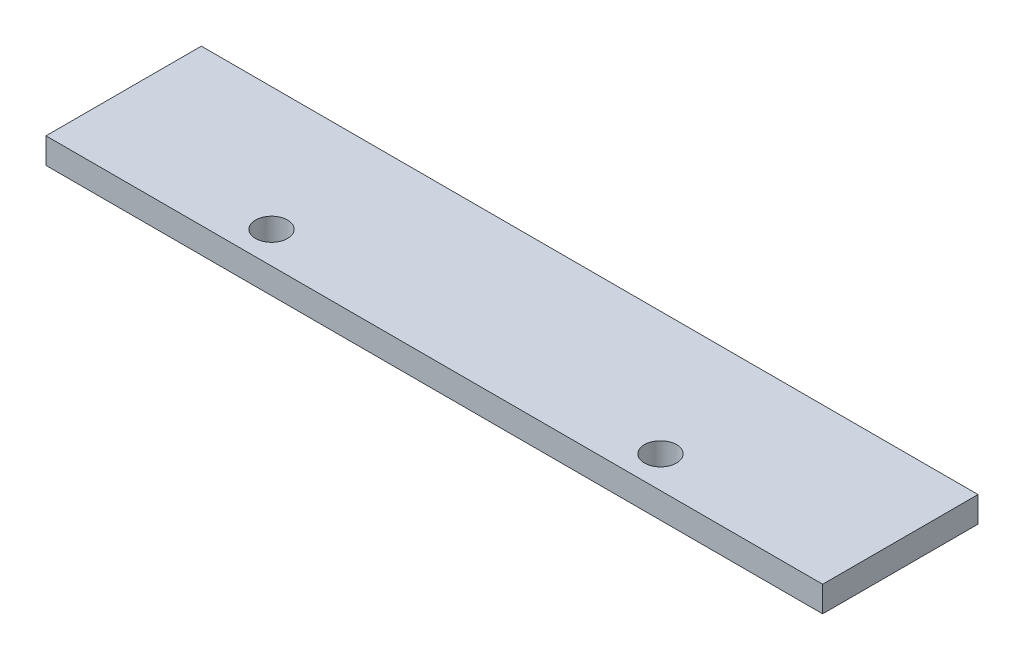
ISO-10303-21;
HEADER;
FILE_DESCRIPTION(('STEP AP214'),'2;1');
FILE_NAME('part.step','',(''),(''),'','','');
FILE_SCHEMA(('AUTOMOTIVE_DESIGN { 1 0 10303 214 1 1 1 1 }'));
ENDSEC;
DATA;
#1=APPLICATION_CONTEXT('core data for automotive mechanical design processes');
#2=APPLICATION_PROTOCOL_DEFINITION('international standard','automotive_design',2000,#1);
#3=PRODUCT_CONTEXT('',#1,'mechanical');
#4=PRODUCT('Part','Part','',(#3));
#5=PRODUCT_RELATED_PRODUCT_CATEGORY('part','',(#4));
#6=PRODUCT_DEFINITION_FORMATION('','',#4);
#7=PRODUCT_DEFINITION_CONTEXT('part definition',#1,'design');
#8=PRODUCT_DEFINITION('design','',#6,#7);
#9=PRODUCT_DEFINITION_SHAPE('','',#8);
#10=(LENGTH_UNIT() NAMED_UNIT(*) SI_UNIT(.MILLI.,.METRE.));
#11=(NAMED_UNIT(*) PLANE_ANGLE_UNIT() SI_UNIT($,.RADIAN.));
#12=(NAMED_UNIT(*) SI_UNIT($,.STERADIAN.) SOLID_ANGLE_UNIT());
#13=UNCERTAINTY_MEASURE_WITH_UNIT(LENGTH_MEASURE(1.E-05),#10,'distance_accuracy_value','');
#14=(GEOMETRIC_REPRESENTATION_CONTEXT(3) GLOBAL_UNCERTAINTY_ASSIGNED_CONTEXT((#13)) GLOBAL_UNIT_ASSIGNED_CONTEXT((#10,
#11,#12)) REPRESENTATION_CONTEXT('',''));
#15=CARTESIAN_POINT('',(0.,0.,0.));
#16=DIRECTION('',(0.,0.,1.));
#17=DIRECTION('',(1.,0.,0.));
#18=AXIS2_PLACEMENT_3D('',#15,#16,#17);
#19=CARTESIAN_POINT('',(25.55,0.845,5.11));
#20=DIRECTION('',(-1.,0.,0.));
#21=DIRECTION('',(0.,0.,1.));
#22=AXIS2_PLACEMENT_3D('',#19,#20,#21);
#23=PLANE('',#22);
#24=DIRECTION('',(0.,0.,-1.));
#25=VECTOR('',#24,1.);
#26=CARTESIAN_POINT('',(25.55,-0.845,5.11));
#27=LINE('',#26,#25);
#28=CARTESIAN_POINT('',(25.55,-0.845,5.11));
#29=VERTEX_POINT('',#28);
#30=CARTESIAN_POINT('',(25.55,-0.845,-5.11));
#31=VERTEX_POINT('',#30);
#32=EDGE_CURVE('E99',#29,#31,#27,.T.);
#33=ORIENTED_EDGE('',*,*,#32,.T.);
#34=DIRECTION('',(0.,-1.,0.));
#35=VECTOR('',#34,1.);
#36=CARTESIAN_POINT('',(25.55,0.845,-5.11));
#37=LINE('',#36,#35);
#38=CARTESIAN_POINT('',(25.55,0.845,-5.11));
#39=VERTEX_POINT('',#38);
#40=EDGE_CURVE('E11',#39,#31,#37,.T.);
#41=ORIENTED_EDGE('',*,*,#40,.F.);
#42=DIRECTION('',(0.,0.,-1.));
#43=VECTOR('',#42,1.);
#44=CARTESIAN_POINT('',(25.55,0.845,5.11));
#45=LINE('',#44,#43);
#46=CARTESIAN_POINT('',(25.55,0.845,5.11));
#47=VERTEX_POINT('',#46);
#48=EDGE_CURVE('E87',#47,#39,#45,.T.);
#49=ORIENTED_EDGE('',*,*,#48,.F.);
#50=DIRECTION('',(0.,-1.,0.));
#51=VECTOR('',#50,1.);
#52=CARTESIAN_POINT('',(25.55,0.845,5.11));
#53=LINE('',#52,#51);
#54=EDGE_CURVE('E95',#47,#29,#53,.T.);
#55=ORIENTED_EDGE('',*,*,#54,.T.);
#56=EDGE_LOOP('',(#33,#41,#49,#55));
#57=FACE_BOUND('',#56,.T.);
#58=ADVANCED_FACE('F36',(#57),#23,.F.);
#59=CARTESIAN_POINT('',(-25.55,0.845,-5.11));
#60=DIRECTION('',(0.,0.,1.));
#61=DIRECTION('',(1.,0.,0.));
#62=AXIS2_PLACEMENT_3D('',#59,#60,#61);
#63=PLANE('',#62);
#64=DIRECTION('',(-1.,0.,0.));
#65=VECTOR('',#64,1.);
#66=CARTESIAN_POINT('',(-25.55,-0.845,-5.11));
#67=LINE('',#66,#65);
#68=CARTESIAN_POINT('',(-25.55,-0.845,-5.11));
#69=VERTEX_POINT('',#68);
#70=EDGE_CURVE('E91',#31,#69,#67,.T.);
#71=ORIENTED_EDGE('',*,*,#70,.T.);
#72=DIRECTION('',(0.,-1.,0.));
#73=VECTOR('',#72,1.);
#74=CARTESIAN_POINT('',(-25.55,0.845,-5.11));
#75=LINE('',#74,#73);
#76=CARTESIAN_POINT('',(-25.55,0.845,-5.11));
#77=VERTEX_POINT('',#76);
#78=EDGE_CURVE('E44',#77,#69,#75,.T.);
#79=ORIENTED_EDGE('',*,*,#78,.F.);
#80=DIRECTION('',(-1.,0.,0.));
#81=VECTOR('',#80,1.);
#82=CARTESIAN_POINT('',(-25.55,0.845,-5.11));
#83=LINE('',#82,#81);
#84=EDGE_CURVE('E82',#39,#77,#83,.T.);
#85=ORIENTED_EDGE('',*,*,#84,.F.);
#86=ORIENTED_EDGE('',*,*,#40,.T.);
#87=EDGE_LOOP('',(#71,#79,#85,#86));
#88=FACE_BOUND('',#87,.T.);
#89=ADVANCED_FACE('F90',(#88),#63,.F.);
#90=CARTESIAN_POINT('',(-25.55,0.845,5.11));
#91=DIRECTION('',(1.,0.,0.));
#92=DIRECTION('',(0.,0.,-1.));
#93=AXIS2_PLACEMENT_3D('',#90,#91,#92);
#94=PLANE('',#93);
#95=DIRECTION('',(0.,0.,1.));
#96=VECTOR('',#95,1.);
#97=CARTESIAN_POINT('',(-25.55,-0.845,5.11));
#98=LINE('',#97,#96);
#99=CARTESIAN_POINT('',(-25.55,-0.845,5.11));
#100=VERTEX_POINT('',#99);
#101=EDGE_CURVE('E69',#69,#100,#98,.T.);
#102=ORIENTED_EDGE('',*,*,#101,.T.);
#103=DIRECTION('',(0.,-1.,0.));
#104=VECTOR('',#103,1.);
#105=CARTESIAN_POINT('',(-25.55,0.845,5.11));
#106=LINE('',#105,#104);
#107=CARTESIAN_POINT('',(-25.55,0.845,5.11));
#108=VERTEX_POINT('',#107);
#109=EDGE_CURVE('E92',#108,#100,#106,.T.);
#110=ORIENTED_EDGE('',*,*,#109,.F.);
#111=DIRECTION('',(0.,0.,1.));
#112=VECTOR('',#111,1.);
#113=CARTESIAN_POINT('',(-25.55,0.845,5.11));
#114=LINE('',#113,#112);
#115=EDGE_CURVE('E85',#77,#108,#114,.T.);
#116=ORIENTED_EDGE('',*,*,#115,.F.);
#117=ORIENTED_EDGE('',*,*,#78,.T.);
#118=EDGE_LOOP('',(#102,#110,#116,#117));
#119=FACE_BOUND('',#118,.T.);
#120=ADVANCED_FACE('F93',(#119),#94,.F.);
#121=CARTESIAN_POINT('',(-25.55,0.845,5.11));
#122=DIRECTION('',(0.,0.,-1.));
#123=DIRECTION('',(-1.,0.,0.));
#124=AXIS2_PLACEMENT_3D('',#121,#122,#123);
#125=PLANE('',#124);
#126=DIRECTION('',(1.,0.,0.));
#127=VECTOR('',#126,1.);
#128=CARTESIAN_POINT('',(-25.55,-0.845,5.11));
#129=LINE('',#128,#127);
#130=EDGE_CURVE('E75',#100,#29,#129,.T.);
#131=ORIENTED_EDGE('',*,*,#130,.T.);
#132=ORIENTED_EDGE('',*,*,#54,.F.);
#133=DIRECTION('',(1.,0.,0.));
#134=VECTOR('',#133,1.);
#135=CARTESIAN_POINT('',(-25.55,0.845,5.11));
#136=LINE('',#135,#134);
#137=EDGE_CURVE('E52',#108,#47,#136,.T.);
#138=ORIENTED_EDGE('',*,*,#137,.F.);
#139=ORIENTED_EDGE('',*,*,#109,.T.);
#140=EDGE_LOOP('',(#131,#132,#138,#139));
#141=FACE_BOUND('',#140,.T.);
#142=ADVANCED_FACE('F107',(#141),#125,.F.);
#143=CARTESIAN_POINT('',(0.,0.845,0.));
#144=DIRECTION('',(0.,-1.,0.));
#145=DIRECTION('',(0.,0.,-1.));
#146=AXIS2_PLACEMENT_3D('',#143,#144,#145);
#147=PLANE('',#146);
#148=CARTESIAN_POINT('',(12.7859935140557,0.845,3.01569041831463));
#149=DIRECTION('',(0.,1.,0.));
#150=DIRECTION('',(0.,0.,1.));
#151=AXIS2_PLACEMENT_3D('',#148,#149,#150);
#152=CIRCLE('',#151,1.05429477609712);
#153=CARTESIAN_POINT('',(12.7859935140557,0.845,4.06998519441175));
#154=VERTEX_POINT('',#153);
#155=EDGE_CURVE('E119',#154,#154,#152,.T.);
#156=ORIENTED_EDGE('',*,*,#155,.F.);
#157=EDGE_LOOP('',(#156));
#158=FACE_BOUND('',#157,.T.);
#159=CARTESIAN_POINT('',(-12.8064961916647,0.845,3.01569041831463));
#160=DIRECTION('',(0.,1.,0.));
#161=DIRECTION('',(0.,0.,1.));
#162=AXIS2_PLACEMENT_3D('',#159,#160,#161);
#163=CIRCLE('',#162,1.05429477609712);
#164=CARTESIAN_POINT('',(-12.8064961916647,0.845,4.06998519441175));
#165=VERTEX_POINT('',#164);
#166=EDGE_CURVE('E113',#165,#165,#163,.T.);
#167=ORIENTED_EDGE('',*,*,#166,.F.);
#168=EDGE_LOOP('',(#167));
#169=FACE_BOUND('',#168,.T.);
#170=ORIENTED_EDGE('',*,*,#48,.T.);
#171=ORIENTED_EDGE('',*,*,#84,.T.);
#172=ORIENTED_EDGE('',*,*,#115,.T.);
#173=ORIENTED_EDGE('',*,*,#137,.T.);
#174=EDGE_LOOP('',(#170,#171,#172,#173));
#175=FACE_BOUND('',#174,.T.);
#176=ADVANCED_FACE('F83',(#158,#169,#175),#147,.F.);
#177=CARTESIAN_POINT('',(0.,-0.845,0.));
#178=DIRECTION('',(0.,-1.,0.));
#179=DIRECTION('',(0.,0.,-1.));
#180=AXIS2_PLACEMENT_3D('',#177,#178,#179);
#181=PLANE('',#180);
#182=CARTESIAN_POINT('',(12.7859935140557,-0.845,3.01569041831463));
#183=DIRECTION('',(0.,1.,0.));
#184=DIRECTION('',(0.,0.,1.));
#185=AXIS2_PLACEMENT_3D('',#182,#183,#184);
#186=CIRCLE('',#185,1.05429477609712);
#187=CARTESIAN_POINT('',(12.7859935140557,-0.845,4.06998519441175));
#188=VERTEX_POINT('',#187);
#189=EDGE_CURVE('E116',#188,#188,#186,.T.);
#190=ORIENTED_EDGE('',*,*,#189,.T.);
#191=EDGE_LOOP('',(#190));
#192=FACE_BOUND('',#191,.T.);
#193=CARTESIAN_POINT('',(-12.8064961916647,-0.845,3.01569041831463));
#194=DIRECTION('',(0.,1.,0.));
#195=DIRECTION('',(0.,0.,1.));
#196=AXIS2_PLACEMENT_3D('',#193,#194,#195);
#197=CIRCLE('',#196,1.05429477609712);
#198=CARTESIAN_POINT('',(-12.8064961916647,-0.845,4.06998519441175));
#199=VERTEX_POINT('',#198);
#200=EDGE_CURVE('E102',#199,#199,#197,.T.);
#201=ORIENTED_EDGE('',*,*,#200,.T.);
#202=EDGE_LOOP('',(#201));
#203=FACE_BOUND('',#202,.T.);
#204=ORIENTED_EDGE('',*,*,#32,.F.);
#205=ORIENTED_EDGE('',*,*,#130,.F.);
#206=ORIENTED_EDGE('',*,*,#101,.F.);
#207=ORIENTED_EDGE('',*,*,#70,.F.);
#208=EDGE_LOOP('',(#204,#205,#206,#207));
#209=FACE_BOUND('',#208,.T.);
#210=ADVANCED_FACE('F110',(#192,#203,#209),#181,.T.);
#211=CARTESIAN_POINT('',(-12.8064961916647,-0.845,3.01569041831463));
#212=DIRECTION('',(0.,1.,0.));
#213=DIRECTION('',(0.,0.,1.));
#214=AXIS2_PLACEMENT_3D('',#211,#212,#213);
#215=CYLINDRICAL_SURFACE('',#214,1.05429477609712);
#216=ORIENTED_EDGE('',*,*,#200,.F.);
#217=EDGE_LOOP('',(#216));
#218=FACE_BOUND('',#217,.T.);
#219=ORIENTED_EDGE('',*,*,#166,.T.);
#220=EDGE_LOOP('',(#219));
#221=FACE_BOUND('',#220,.T.);
#222=ADVANCED_FACE('F130',(#218,#221),#215,.F.);
#223=CARTESIAN_POINT('',(12.7859935140557,-0.845,3.01569041831463));
#224=DIRECTION('',(0.,1.,0.));
#225=DIRECTION('',(0.,0.,1.));
#226=AXIS2_PLACEMENT_3D('',#223,#224,#225);
#227=CYLINDRICAL_SURFACE('',#226,1.05429477609712);
#228=ORIENTED_EDGE('',*,*,#189,.F.);
#229=EDGE_LOOP('',(#228));
#230=FACE_BOUND('',#229,.T.);
#231=ORIENTED_EDGE('',*,*,#155,.T.);
#232=EDGE_LOOP('',(#231));
#233=FACE_BOUND('',#232,.T.);
#234=ADVANCED_FACE('F127',(#230,#233),#227,.F.);
#235=CLOSED_SHELL('',(#58,#89,#120,#142,#176,#210,#222,#234));
#236=MANIFOLD_SOLID_BREP('B2',#235);
#237=ADVANCED_BREP_SHAPE_REPRESENTATION('',(#18,#236),#14);
#238=SHAPE_DEFINITION_REPRESENTATION(#9,#237);
ENDSEC;
END-ISO-10303-21;
